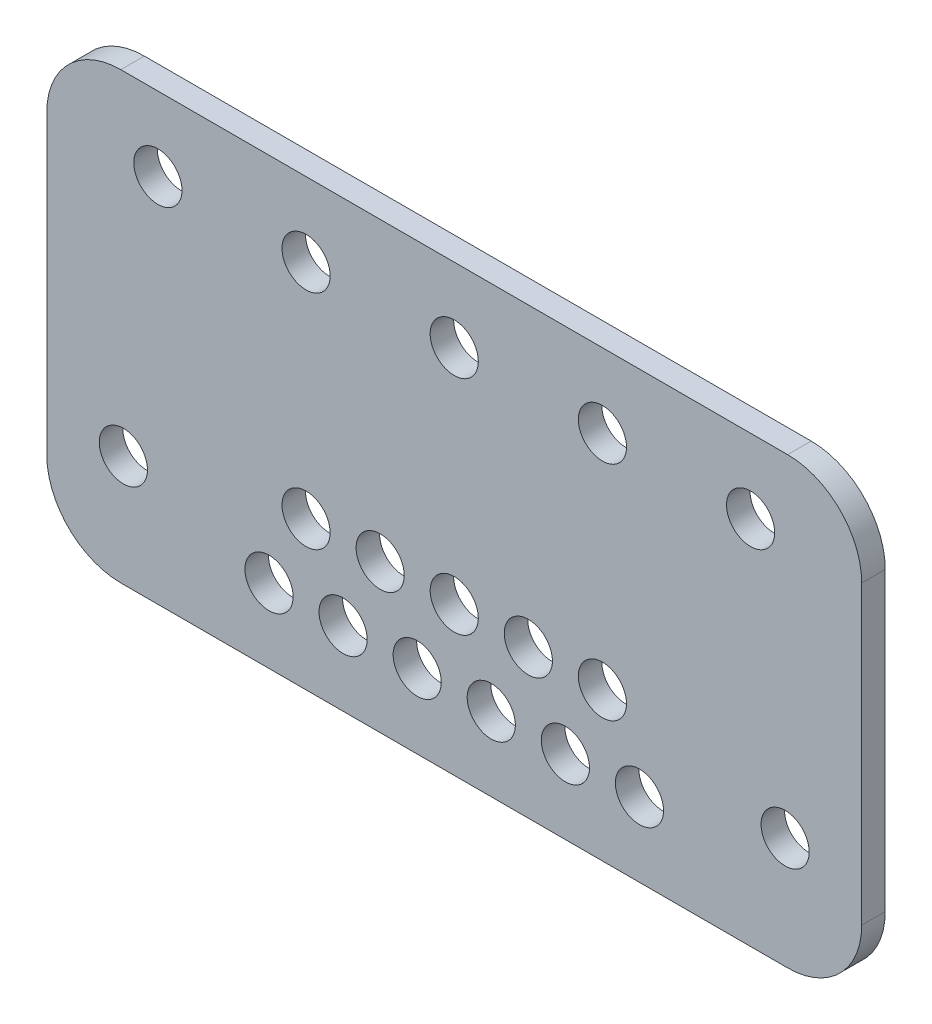
ISO-10303-21;
HEADER;
FILE_DESCRIPTION(('STEP AP214'),'2;1');
FILE_NAME('part.step','',(''),(''),'','','');
FILE_SCHEMA(('AUTOMOTIVE_DESIGN { 1 0 10303 214 1 1 1 1 }'));
ENDSEC;
DATA;
#1=APPLICATION_CONTEXT('core data for automotive mechanical design processes');
#2=APPLICATION_PROTOCOL_DEFINITION('international standard','automotive_design',2000,#1);
#3=PRODUCT_CONTEXT('',#1,'mechanical');
#4=PRODUCT('Part','Part','',(#3));
#5=PRODUCT_RELATED_PRODUCT_CATEGORY('part','',(#4));
#6=PRODUCT_DEFINITION_FORMATION('','',#4);
#7=PRODUCT_DEFINITION_CONTEXT('part definition',#1,'design');
#8=PRODUCT_DEFINITION('design','',#6,#7);
#9=PRODUCT_DEFINITION_SHAPE('','',#8);
#10=(LENGTH_UNIT() NAMED_UNIT(*) SI_UNIT(.MILLI.,.METRE.));
#11=(NAMED_UNIT(*) PLANE_ANGLE_UNIT() SI_UNIT($,.RADIAN.));
#12=(NAMED_UNIT(*) SI_UNIT($,.STERADIAN.) SOLID_ANGLE_UNIT());
#13=UNCERTAINTY_MEASURE_WITH_UNIT(LENGTH_MEASURE(1.E-05),#10,'distance_accuracy_value','');
#14=(GEOMETRIC_REPRESENTATION_CONTEXT(3) GLOBAL_UNCERTAINTY_ASSIGNED_CONTEXT((#13)) GLOBAL_UNIT_ASSIGNED_CONTEXT((#10,
#11,#12)) REPRESENTATION_CONTEXT('',''));
#15=CARTESIAN_POINT('',(0.,0.,0.));
#16=DIRECTION('',(0.,0.,1.));
#17=DIRECTION('',(1.,0.,0.));
#18=AXIS2_PLACEMENT_3D('',#15,#16,#17);
#19=CARTESIAN_POINT('',(55.,-30.,3.175));
#20=DIRECTION('',(-1.,0.,0.));
#21=DIRECTION('',(0.,0.,1.));
#22=AXIS2_PLACEMENT_3D('',#19,#20,#21);
#23=PLANE('',#22);
#24=DIRECTION('',(0.,1.,0.));
#25=VECTOR('',#24,1.);
#26=CARTESIAN_POINT('',(55.,-30.,0.));
#27=LINE('',#26,#25);
#28=CARTESIAN_POINT('',(55.,-20.,0.));
#29=VERTEX_POINT('',#28);
#30=CARTESIAN_POINT('',(55.,20.,0.));
#31=VERTEX_POINT('',#30);
#32=EDGE_CURVE('E127',#29,#31,#27,.T.);
#33=ORIENTED_EDGE('',*,*,#32,.T.);
#34=DIRECTION('',(0.,0.,-1.));
#35=VECTOR('',#34,1.);
#36=CARTESIAN_POINT('',(55.,20.,3.175));
#37=LINE('',#36,#35);
#38=CARTESIAN_POINT('',(55.,20.,3.175));
#39=VERTEX_POINT('',#38);
#40=EDGE_CURVE('E105',#31,#39,#37,.F.);
#41=ORIENTED_EDGE('',*,*,#40,.T.);
#42=DIRECTION('',(0.,1.,0.));
#43=VECTOR('',#42,1.);
#44=CARTESIAN_POINT('',(55.,-30.,3.175));
#45=LINE('',#44,#43);
#46=CARTESIAN_POINT('',(55.,-20.,3.175));
#47=VERTEX_POINT('',#46);
#48=EDGE_CURVE('E137',#47,#39,#45,.T.);
#49=ORIENTED_EDGE('',*,*,#48,.F.);
#50=DIRECTION('',(0.,0.,-1.));
#51=VECTOR('',#50,1.);
#52=CARTESIAN_POINT('',(55.,-20.,3.175));
#53=LINE('',#52,#51);
#54=EDGE_CURVE('E110',#47,#29,#53,.T.);
#55=ORIENTED_EDGE('',*,*,#54,.T.);
#56=EDGE_LOOP('',(#33,#41,#49,#55));
#57=FACE_BOUND('',#56,.T.);
#58=ADVANCED_FACE('F34',(#57),#23,.F.);
#59=CARTESIAN_POINT('',(-55.,30.,3.175));
#60=DIRECTION('',(0.,-1.,0.));
#61=DIRECTION('',(0.,0.,-1.));
#62=AXIS2_PLACEMENT_3D('',#59,#60,#61);
#63=PLANE('',#62);
#64=DIRECTION('',(-1.,0.,0.));
#65=VECTOR('',#64,1.);
#66=CARTESIAN_POINT('',(-55.,30.,3.175));
#67=LINE('',#66,#65);
#68=CARTESIAN_POINT('',(45.,30.,3.175));
#69=VERTEX_POINT('',#68);
#70=CARTESIAN_POINT('',(-45.,30.,3.175));
#71=VERTEX_POINT('',#70);
#72=EDGE_CURVE('E120',#69,#71,#67,.T.);
#73=ORIENTED_EDGE('',*,*,#72,.F.);
#74=DIRECTION('',(0.,0.,-1.));
#75=VECTOR('',#74,1.);
#76=CARTESIAN_POINT('',(45.,30.,3.175));
#77=LINE('',#76,#75);
#78=CARTESIAN_POINT('',(45.,30.,0.));
#79=VERTEX_POINT('',#78);
#80=EDGE_CURVE('E104',#69,#79,#77,.T.);
#81=ORIENTED_EDGE('',*,*,#80,.T.);
#82=DIRECTION('',(-1.,0.,0.));
#83=VECTOR('',#82,1.);
#84=CARTESIAN_POINT('',(-55.,30.,0.));
#85=LINE('',#84,#83);
#86=CARTESIAN_POINT('',(-45.,30.,0.));
#87=VERTEX_POINT('',#86);
#88=EDGE_CURVE('E117',#79,#87,#85,.T.);
#89=ORIENTED_EDGE('',*,*,#88,.T.);
#90=DIRECTION('',(0.,0.,-1.));
#91=VECTOR('',#90,1.);
#92=CARTESIAN_POINT('',(-45.,30.,3.175));
#93=LINE('',#92,#91);
#94=EDGE_CURVE('E122',#87,#71,#93,.F.);
#95=ORIENTED_EDGE('',*,*,#94,.T.);
#96=EDGE_LOOP('',(#73,#81,#89,#95));
#97=FACE_BOUND('',#96,.T.);
#98=ADVANCED_FACE('F116',(#97),#63,.F.);
#99=CARTESIAN_POINT('',(-55.,-30.,3.175));
#100=DIRECTION('',(1.,0.,0.));
#101=DIRECTION('',(0.,0.,-1.));
#102=AXIS2_PLACEMENT_3D('',#99,#100,#101);
#103=PLANE('',#102);
#104=DIRECTION('',(0.,-1.,0.));
#105=VECTOR('',#104,1.);
#106=CARTESIAN_POINT('',(-55.,-30.,3.175));
#107=LINE('',#106,#105);
#108=CARTESIAN_POINT('',(-55.,20.,3.175));
#109=VERTEX_POINT('',#108);
#110=CARTESIAN_POINT('',(-55.,-20.,3.175));
#111=VERTEX_POINT('',#110);
#112=EDGE_CURVE('E163',#109,#111,#107,.T.);
#113=ORIENTED_EDGE('',*,*,#112,.F.);
#114=DIRECTION('',(0.,0.,-1.));
#115=VECTOR('',#114,1.);
#116=CARTESIAN_POINT('',(-55.,20.,3.175));
#117=LINE('',#116,#115);
#118=CARTESIAN_POINT('',(-55.,20.,0.));
#119=VERTEX_POINT('',#118);
#120=EDGE_CURVE('E156',#109,#119,#117,.T.);
#121=ORIENTED_EDGE('',*,*,#120,.T.);
#122=DIRECTION('',(0.,-1.,0.));
#123=VECTOR('',#122,1.);
#124=CARTESIAN_POINT('',(-55.,-30.,0.));
#125=LINE('',#124,#123);
#126=CARTESIAN_POINT('',(-55.,-20.,0.));
#127=VERTEX_POINT('',#126);
#128=EDGE_CURVE('E126',#119,#127,#125,.T.);
#129=ORIENTED_EDGE('',*,*,#128,.T.);
#130=DIRECTION('',(0.,0.,-1.));
#131=VECTOR('',#130,1.);
#132=CARTESIAN_POINT('',(-55.,-20.,3.175));
#133=LINE('',#132,#131);
#134=EDGE_CURVE('E154',#127,#111,#133,.F.);
#135=ORIENTED_EDGE('',*,*,#134,.T.);
#136=EDGE_LOOP('',(#113,#121,#129,#135));
#137=FACE_BOUND('',#136,.T.);
#138=ADVANCED_FACE('F161',(#137),#103,.F.);
#139=CARTESIAN_POINT('',(-55.,-30.,3.175));
#140=DIRECTION('',(0.,1.,0.));
#141=DIRECTION('',(0.,0.,1.));
#142=AXIS2_PLACEMENT_3D('',#139,#140,#141);
#143=PLANE('',#142);
#144=DIRECTION('',(1.,0.,0.));
#145=VECTOR('',#144,1.);
#146=CARTESIAN_POINT('',(-55.,-30.,3.175));
#147=LINE('',#146,#145);
#148=CARTESIAN_POINT('',(-45.,-30.,3.175));
#149=VERTEX_POINT('',#148);
#150=CARTESIAN_POINT('',(45.,-30.,3.175));
#151=VERTEX_POINT('',#150);
#152=EDGE_CURVE('E138',#149,#151,#147,.T.);
#153=ORIENTED_EDGE('',*,*,#152,.F.);
#154=DIRECTION('',(0.,0.,-1.));
#155=VECTOR('',#154,1.);
#156=CARTESIAN_POINT('',(-45.,-30.,3.175));
#157=LINE('',#156,#155);
#158=CARTESIAN_POINT('',(-45.,-30.,0.));
#159=VERTEX_POINT('',#158);
#160=EDGE_CURVE('E11',#149,#159,#157,.T.);
#161=ORIENTED_EDGE('',*,*,#160,.T.);
#162=DIRECTION('',(1.,0.,0.));
#163=VECTOR('',#162,1.);
#164=CARTESIAN_POINT('',(-55.,-30.,0.));
#165=LINE('',#164,#163);
#166=CARTESIAN_POINT('',(45.,-30.,0.));
#167=VERTEX_POINT('',#166);
#168=EDGE_CURVE('E130',#159,#167,#165,.T.);
#169=ORIENTED_EDGE('',*,*,#168,.T.);
#170=DIRECTION('',(0.,0.,-1.));
#171=VECTOR('',#170,1.);
#172=CARTESIAN_POINT('',(45.,-30.,3.175));
#173=LINE('',#172,#171);
#174=EDGE_CURVE('E42',#167,#151,#173,.F.);
#175=ORIENTED_EDGE('',*,*,#174,.T.);
#176=EDGE_LOOP('',(#153,#161,#169,#175));
#177=FACE_BOUND('',#176,.T.);
#178=ADVANCED_FACE('F170',(#177),#143,.F.);
#179=CARTESIAN_POINT('',(0.,0.,3.175));
#180=DIRECTION('',(0.,0.,-1.));
#181=DIRECTION('',(-1.,0.,0.));
#182=AXIS2_PLACEMENT_3D('',#179,#180,#181);
#183=PLANE('',#182);
#184=CARTESIAN_POINT('',(25.,-20.,3.175));
#185=DIRECTION('',(0.,0.,1.));
#186=DIRECTION('',(1.,0.,0.));
#187=AXIS2_PLACEMENT_3D('',#184,#185,#186);
#188=CIRCLE('',#187,3.25);
#189=CARTESIAN_POINT('',(28.25,-20.,3.175));
#190=VERTEX_POINT('',#189);
#191=EDGE_CURVE('E279',#190,#190,#188,.T.);
#192=ORIENTED_EDGE('',*,*,#191,.F.);
#193=EDGE_LOOP('',(#192));
#194=FACE_BOUND('',#193,.T.);
#195=CARTESIAN_POINT('',(-25.,-20.,3.175));
#196=DIRECTION('',(0.,0.,1.));
#197=DIRECTION('',(1.,0.,0.));
#198=AXIS2_PLACEMENT_3D('',#195,#196,#197);
#199=CIRCLE('',#198,3.25);
#200=CARTESIAN_POINT('',(-21.75,-20.,3.175));
#201=VERTEX_POINT('',#200);
#202=EDGE_CURVE('E273',#201,#201,#199,.T.);
#203=ORIENTED_EDGE('',*,*,#202,.F.);
#204=EDGE_LOOP('',(#203));
#205=FACE_BOUND('',#204,.T.);
#206=CARTESIAN_POINT('',(15.,-20.,3.175));
#207=DIRECTION('',(0.,0.,1.));
#208=DIRECTION('',(1.,0.,0.));
#209=AXIS2_PLACEMENT_3D('',#206,#207,#208);
#210=CIRCLE('',#209,3.25);
#211=CARTESIAN_POINT('',(18.25,-20.,3.175));
#212=VERTEX_POINT('',#211);
#213=EDGE_CURVE('E267',#212,#212,#210,.T.);
#214=ORIENTED_EDGE('',*,*,#213,.F.);
#215=EDGE_LOOP('',(#214));
#216=FACE_BOUND('',#215,.T.);
#217=CARTESIAN_POINT('',(20.,-9.99999999999999,3.175));
#218=DIRECTION('',(0.,0.,1.));
#219=DIRECTION('',(1.,0.,0.));
#220=AXIS2_PLACEMENT_3D('',#217,#218,#219);
#221=CIRCLE('',#220,3.25);
#222=CARTESIAN_POINT('',(23.25,-9.99999999999999,3.175));
#223=VERTEX_POINT('',#222);
#224=EDGE_CURVE('E261',#223,#223,#221,.T.);
#225=ORIENTED_EDGE('',*,*,#224,.F.);
#226=EDGE_LOOP('',(#225));
#227=FACE_BOUND('',#226,.T.);
#228=CARTESIAN_POINT('',(-44.66,-15.,3.175));
#229=DIRECTION('',(0.,0.,1.));
#230=DIRECTION('',(1.,0.,0.));
#231=AXIS2_PLACEMENT_3D('',#228,#229,#230);
#232=CIRCLE('',#231,3.25);
#233=CARTESIAN_POINT('',(-41.41,-15.,3.175));
#234=VERTEX_POINT('',#233);
#235=EDGE_CURVE('E255',#234,#234,#232,.T.);
#236=ORIENTED_EDGE('',*,*,#235,.F.);
#237=EDGE_LOOP('',(#236));
#238=FACE_BOUND('',#237,.T.);
#239=CARTESIAN_POINT('',(-20.,-9.99999999999999,3.175));
#240=DIRECTION('',(0.,0.,1.));
#241=DIRECTION('',(1.,0.,0.));
#242=AXIS2_PLACEMENT_3D('',#239,#240,#241);
#243=CIRCLE('',#242,3.25);
#244=CARTESIAN_POINT('',(-16.75,-9.99999999999999,3.175));
#245=VERTEX_POINT('',#244);
#246=EDGE_CURVE('E249',#245,#245,#243,.T.);
#247=ORIENTED_EDGE('',*,*,#246,.F.);
#248=EDGE_LOOP('',(#247));
#249=FACE_BOUND('',#248,.T.);
#250=CARTESIAN_POINT('',(10.,-9.99999999999999,3.175));
#251=DIRECTION('',(0.,0.,1.));
#252=DIRECTION('',(1.,0.,0.));
#253=AXIS2_PLACEMENT_3D('',#250,#251,#252);
#254=CIRCLE('',#253,3.25);
#255=CARTESIAN_POINT('',(13.25,-9.99999999999999,3.175));
#256=VERTEX_POINT('',#255);
#257=EDGE_CURVE('E243',#256,#256,#254,.T.);
#258=ORIENTED_EDGE('',*,*,#257,.F.);
#259=EDGE_LOOP('',(#258));
#260=FACE_BOUND('',#259,.T.);
#261=CARTESIAN_POINT('',(-15.,-20.,3.175));
#262=DIRECTION('',(0.,0.,1.));
#263=DIRECTION('',(1.,0.,0.));
#264=AXIS2_PLACEMENT_3D('',#261,#262,#263);
#265=CIRCLE('',#264,3.25);
#266=CARTESIAN_POINT('',(-11.75,-20.,3.175));
#267=VERTEX_POINT('',#266);
#268=EDGE_CURVE('E237',#267,#267,#265,.T.);
#269=ORIENTED_EDGE('',*,*,#268,.F.);
#270=EDGE_LOOP('',(#269));
#271=FACE_BOUND('',#270,.T.);
#272=CARTESIAN_POINT('',(-10.,-9.99999999999999,3.175));
#273=DIRECTION('',(0.,0.,1.));
#274=DIRECTION('',(1.,0.,0.));
#275=AXIS2_PLACEMENT_3D('',#272,#273,#274);
#276=CIRCLE('',#275,3.25);
#277=CARTESIAN_POINT('',(-6.75,-9.99999999999999,3.175));
#278=VERTEX_POINT('',#277);
#279=EDGE_CURVE('E231',#278,#278,#276,.T.);
#280=ORIENTED_EDGE('',*,*,#279,.F.);
#281=EDGE_LOOP('',(#280));
#282=FACE_BOUND('',#281,.T.);
#283=CARTESIAN_POINT('',(-5.,-20.,3.175));
#284=DIRECTION('',(0.,0.,1.));
#285=DIRECTION('',(1.,0.,0.));
#286=AXIS2_PLACEMENT_3D('',#283,#284,#285);
#287=CIRCLE('',#286,3.25);
#288=CARTESIAN_POINT('',(-1.75,-20.,3.175));
#289=VERTEX_POINT('',#288);
#290=EDGE_CURVE('E225',#289,#289,#287,.T.);
#291=ORIENTED_EDGE('',*,*,#290,.F.);
#292=EDGE_LOOP('',(#291));
#293=FACE_BOUND('',#292,.T.);
#294=CARTESIAN_POINT('',(0.,-9.99999999999999,3.175));
#295=DIRECTION('',(0.,0.,1.));
#296=DIRECTION('',(1.,0.,0.));
#297=AXIS2_PLACEMENT_3D('',#294,#295,#296);
#298=CIRCLE('',#297,3.25);
#299=CARTESIAN_POINT('',(3.25,-9.99999999999999,3.175));
#300=VERTEX_POINT('',#299);
#301=EDGE_CURVE('E219',#300,#300,#298,.T.);
#302=ORIENTED_EDGE('',*,*,#301,.F.);
#303=EDGE_LOOP('',(#302));
#304=FACE_BOUND('',#303,.T.);
#305=CARTESIAN_POINT('',(5.,-20.,3.175));
#306=DIRECTION('',(0.,0.,1.));
#307=DIRECTION('',(1.,0.,0.));
#308=AXIS2_PLACEMENT_3D('',#305,#306,#307);
#309=CIRCLE('',#308,3.25);
#310=CARTESIAN_POINT('',(8.25,-20.,3.175));
#311=VERTEX_POINT('',#310);
#312=EDGE_CURVE('E213',#311,#311,#309,.T.);
#313=ORIENTED_EDGE('',*,*,#312,.F.);
#314=EDGE_LOOP('',(#313));
#315=FACE_BOUND('',#314,.T.);
#316=CARTESIAN_POINT('',(44.66,-15.,3.175));
#317=DIRECTION('',(0.,0.,1.));
#318=DIRECTION('',(1.,0.,0.));
#319=AXIS2_PLACEMENT_3D('',#316,#317,#318);
#320=CIRCLE('',#319,3.25);
#321=CARTESIAN_POINT('',(47.91,-15.,3.175));
#322=VERTEX_POINT('',#321);
#323=EDGE_CURVE('E207',#322,#322,#320,.T.);
#324=ORIENTED_EDGE('',*,*,#323,.F.);
#325=EDGE_LOOP('',(#324));
#326=FACE_BOUND('',#325,.T.);
#327=CARTESIAN_POINT('',(20.,20.,3.175));
#328=DIRECTION('',(0.,0.,1.));
#329=DIRECTION('',(1.,0.,0.));
#330=AXIS2_PLACEMENT_3D('',#327,#328,#329);
#331=CIRCLE('',#330,3.25);
#332=CARTESIAN_POINT('',(23.25,20.,3.175));
#333=VERTEX_POINT('',#332);
#334=EDGE_CURVE('E201',#333,#333,#331,.T.);
#335=ORIENTED_EDGE('',*,*,#334,.F.);
#336=EDGE_LOOP('',(#335));
#337=FACE_BOUND('',#336,.T.);
#338=CARTESIAN_POINT('',(0.,20.,3.175));
#339=DIRECTION('',(0.,0.,1.));
#340=DIRECTION('',(1.,0.,0.));
#341=AXIS2_PLACEMENT_3D('',#338,#339,#340);
#342=CIRCLE('',#341,3.25);
#343=CARTESIAN_POINT('',(3.25,20.,3.175));
#344=VERTEX_POINT('',#343);
#345=EDGE_CURVE('E195',#344,#344,#342,.T.);
#346=ORIENTED_EDGE('',*,*,#345,.F.);
#347=EDGE_LOOP('',(#346));
#348=FACE_BOUND('',#347,.T.);
#349=CARTESIAN_POINT('',(-20.,20.,3.175));
#350=DIRECTION('',(0.,0.,1.));
#351=DIRECTION('',(1.,0.,0.));
#352=AXIS2_PLACEMENT_3D('',#349,#350,#351);
#353=CIRCLE('',#352,3.25);
#354=CARTESIAN_POINT('',(-16.75,20.,3.175));
#355=VERTEX_POINT('',#354);
#356=EDGE_CURVE('E189',#355,#355,#353,.T.);
#357=ORIENTED_EDGE('',*,*,#356,.F.);
#358=EDGE_LOOP('',(#357));
#359=FACE_BOUND('',#358,.T.);
#360=CARTESIAN_POINT('',(40.,20.,3.175));
#361=DIRECTION('',(0.,0.,1.));
#362=DIRECTION('',(1.,0.,0.));
#363=AXIS2_PLACEMENT_3D('',#360,#361,#362);
#364=CIRCLE('',#363,3.25);
#365=CARTESIAN_POINT('',(43.25,20.,3.175));
#366=VERTEX_POINT('',#365);
#367=EDGE_CURVE('E183',#366,#366,#364,.T.);
#368=ORIENTED_EDGE('',*,*,#367,.F.);
#369=EDGE_LOOP('',(#368));
#370=FACE_BOUND('',#369,.T.);
#371=CARTESIAN_POINT('',(-40.,20.,3.175));
#372=DIRECTION('',(0.,0.,1.));
#373=DIRECTION('',(1.,0.,0.));
#374=AXIS2_PLACEMENT_3D('',#371,#372,#373);
#375=CIRCLE('',#374,3.25);
#376=CARTESIAN_POINT('',(-36.75,20.,3.175));
#377=VERTEX_POINT('',#376);
#378=EDGE_CURVE('E177',#377,#377,#375,.T.);
#379=ORIENTED_EDGE('',*,*,#378,.F.);
#380=EDGE_LOOP('',(#379));
#381=FACE_BOUND('',#380,.T.);
#382=ORIENTED_EDGE('',*,*,#48,.T.);
#383=CARTESIAN_POINT('',(45.,20.,3.175));
#384=DIRECTION('',(0.,0.,-1.));
#385=DIRECTION('',(-1.,0.,0.));
#386=AXIS2_PLACEMENT_3D('',#383,#384,#385);
#387=CIRCLE('',#386,10.);
#388=EDGE_CURVE('E152',#39,#69,#387,.F.);
#389=ORIENTED_EDGE('',*,*,#388,.T.);
#390=ORIENTED_EDGE('',*,*,#72,.T.);
#391=CARTESIAN_POINT('',(-45.,20.,3.175));
#392=DIRECTION('',(0.,0.,-1.));
#393=DIRECTION('',(-1.,0.,0.));
#394=AXIS2_PLACEMENT_3D('',#391,#392,#393);
#395=CIRCLE('',#394,10.);
#396=EDGE_CURVE('E150',#71,#109,#395,.F.);
#397=ORIENTED_EDGE('',*,*,#396,.T.);
#398=ORIENTED_EDGE('',*,*,#112,.T.);
#399=CARTESIAN_POINT('',(-45.,-20.,3.175));
#400=DIRECTION('',(0.,0.,-1.));
#401=DIRECTION('',(-1.,0.,0.));
#402=AXIS2_PLACEMENT_3D('',#399,#400,#401);
#403=CIRCLE('',#402,10.);
#404=EDGE_CURVE('E55',#111,#149,#403,.F.);
#405=ORIENTED_EDGE('',*,*,#404,.T.);
#406=ORIENTED_EDGE('',*,*,#152,.T.);
#407=CARTESIAN_POINT('',(45.,-20.,3.175));
#408=DIRECTION('',(0.,0.,-1.));
#409=DIRECTION('',(-1.,0.,0.));
#410=AXIS2_PLACEMENT_3D('',#407,#408,#409);
#411=CIRCLE('',#410,10.);
#412=EDGE_CURVE('E147',#151,#47,#411,.F.);
#413=ORIENTED_EDGE('',*,*,#412,.T.);
#414=EDGE_LOOP('',(#382,#389,#390,#397,#398,#405,#406,#413));
#415=FACE_BOUND('',#414,.T.);
#416=ADVANCED_FACE('F294',(#194,#205,#216,#227,#238,#249,#260,#271,#282,#293,#304,#315,#326,
#337,#348,#359,#370,#381,#415),#183,.F.);
#417=CARTESIAN_POINT('',(0.,0.,0.));
#418=DIRECTION('',(0.,0.,-1.));
#419=DIRECTION('',(-1.,0.,0.));
#420=AXIS2_PLACEMENT_3D('',#417,#418,#419);
#421=PLANE('',#420);
#422=CARTESIAN_POINT('',(25.,-20.,0.));
#423=DIRECTION('',(0.,0.,1.));
#424=DIRECTION('',(1.,0.,0.));
#425=AXIS2_PLACEMENT_3D('',#422,#423,#424);
#426=CIRCLE('',#425,3.25);
#427=CARTESIAN_POINT('',(28.25,-20.,0.));
#428=VERTEX_POINT('',#427);
#429=EDGE_CURVE('E276',#428,#428,#426,.T.);
#430=ORIENTED_EDGE('',*,*,#429,.T.);
#431=EDGE_LOOP('',(#430));
#432=FACE_BOUND('',#431,.T.);
#433=CARTESIAN_POINT('',(-25.,-20.,0.));
#434=DIRECTION('',(0.,0.,1.));
#435=DIRECTION('',(1.,0.,0.));
#436=AXIS2_PLACEMENT_3D('',#433,#434,#435);
#437=CIRCLE('',#436,3.25);
#438=CARTESIAN_POINT('',(-21.75,-20.,0.));
#439=VERTEX_POINT('',#438);
#440=EDGE_CURVE('E270',#439,#439,#437,.T.);
#441=ORIENTED_EDGE('',*,*,#440,.T.);
#442=EDGE_LOOP('',(#441));
#443=FACE_BOUND('',#442,.T.);
#444=CARTESIAN_POINT('',(15.,-20.,0.));
#445=DIRECTION('',(0.,0.,1.));
#446=DIRECTION('',(1.,0.,0.));
#447=AXIS2_PLACEMENT_3D('',#444,#445,#446);
#448=CIRCLE('',#447,3.25);
#449=CARTESIAN_POINT('',(18.25,-20.,0.));
#450=VERTEX_POINT('',#449);
#451=EDGE_CURVE('E264',#450,#450,#448,.T.);
#452=ORIENTED_EDGE('',*,*,#451,.T.);
#453=EDGE_LOOP('',(#452));
#454=FACE_BOUND('',#453,.T.);
#455=CARTESIAN_POINT('',(20.,-9.99999999999999,0.));
#456=DIRECTION('',(0.,0.,1.));
#457=DIRECTION('',(1.,0.,0.));
#458=AXIS2_PLACEMENT_3D('',#455,#456,#457);
#459=CIRCLE('',#458,3.25);
#460=CARTESIAN_POINT('',(23.25,-9.99999999999999,0.));
#461=VERTEX_POINT('',#460);
#462=EDGE_CURVE('E258',#461,#461,#459,.T.);
#463=ORIENTED_EDGE('',*,*,#462,.T.);
#464=EDGE_LOOP('',(#463));
#465=FACE_BOUND('',#464,.T.);
#466=CARTESIAN_POINT('',(-44.66,-15.,0.));
#467=DIRECTION('',(0.,0.,1.));
#468=DIRECTION('',(1.,0.,0.));
#469=AXIS2_PLACEMENT_3D('',#466,#467,#468);
#470=CIRCLE('',#469,3.25);
#471=CARTESIAN_POINT('',(-41.41,-15.,0.));
#472=VERTEX_POINT('',#471);
#473=EDGE_CURVE('E252',#472,#472,#470,.T.);
#474=ORIENTED_EDGE('',*,*,#473,.T.);
#475=EDGE_LOOP('',(#474));
#476=FACE_BOUND('',#475,.T.);
#477=CARTESIAN_POINT('',(-20.,-9.99999999999999,0.));
#478=DIRECTION('',(0.,0.,1.));
#479=DIRECTION('',(1.,0.,0.));
#480=AXIS2_PLACEMENT_3D('',#477,#478,#479);
#481=CIRCLE('',#480,3.25);
#482=CARTESIAN_POINT('',(-16.75,-9.99999999999999,0.));
#483=VERTEX_POINT('',#482);
#484=EDGE_CURVE('E246',#483,#483,#481,.T.);
#485=ORIENTED_EDGE('',*,*,#484,.T.);
#486=EDGE_LOOP('',(#485));
#487=FACE_BOUND('',#486,.T.);
#488=CARTESIAN_POINT('',(10.,-9.99999999999999,0.));
#489=DIRECTION('',(0.,0.,1.));
#490=DIRECTION('',(1.,0.,0.));
#491=AXIS2_PLACEMENT_3D('',#488,#489,#490);
#492=CIRCLE('',#491,3.25);
#493=CARTESIAN_POINT('',(13.25,-9.99999999999999,0.));
#494=VERTEX_POINT('',#493);
#495=EDGE_CURVE('E240',#494,#494,#492,.T.);
#496=ORIENTED_EDGE('',*,*,#495,.T.);
#497=EDGE_LOOP('',(#496));
#498=FACE_BOUND('',#497,.T.);
#499=CARTESIAN_POINT('',(-15.,-20.,0.));
#500=DIRECTION('',(0.,0.,1.));
#501=DIRECTION('',(1.,0.,0.));
#502=AXIS2_PLACEMENT_3D('',#499,#500,#501);
#503=CIRCLE('',#502,3.25);
#504=CARTESIAN_POINT('',(-11.75,-20.,0.));
#505=VERTEX_POINT('',#504);
#506=EDGE_CURVE('E234',#505,#505,#503,.T.);
#507=ORIENTED_EDGE('',*,*,#506,.T.);
#508=EDGE_LOOP('',(#507));
#509=FACE_BOUND('',#508,.T.);
#510=CARTESIAN_POINT('',(-10.,-9.99999999999999,0.));
#511=DIRECTION('',(0.,0.,1.));
#512=DIRECTION('',(1.,0.,0.));
#513=AXIS2_PLACEMENT_3D('',#510,#511,#512);
#514=CIRCLE('',#513,3.25);
#515=CARTESIAN_POINT('',(-6.75,-9.99999999999999,0.));
#516=VERTEX_POINT('',#515);
#517=EDGE_CURVE('E228',#516,#516,#514,.T.);
#518=ORIENTED_EDGE('',*,*,#517,.T.);
#519=EDGE_LOOP('',(#518));
#520=FACE_BOUND('',#519,.T.);
#521=CARTESIAN_POINT('',(-5.,-20.,0.));
#522=DIRECTION('',(0.,0.,1.));
#523=DIRECTION('',(1.,0.,0.));
#524=AXIS2_PLACEMENT_3D('',#521,#522,#523);
#525=CIRCLE('',#524,3.25);
#526=CARTESIAN_POINT('',(-1.75,-20.,0.));
#527=VERTEX_POINT('',#526);
#528=EDGE_CURVE('E222',#527,#527,#525,.T.);
#529=ORIENTED_EDGE('',*,*,#528,.T.);
#530=EDGE_LOOP('',(#529));
#531=FACE_BOUND('',#530,.T.);
#532=CARTESIAN_POINT('',(0.,-9.99999999999999,0.));
#533=DIRECTION('',(0.,0.,1.));
#534=DIRECTION('',(1.,0.,0.));
#535=AXIS2_PLACEMENT_3D('',#532,#533,#534);
#536=CIRCLE('',#535,3.25);
#537=CARTESIAN_POINT('',(3.25,-9.99999999999999,0.));
#538=VERTEX_POINT('',#537);
#539=EDGE_CURVE('E216',#538,#538,#536,.T.);
#540=ORIENTED_EDGE('',*,*,#539,.T.);
#541=EDGE_LOOP('',(#540));
#542=FACE_BOUND('',#541,.T.);
#543=CARTESIAN_POINT('',(5.,-20.,0.));
#544=DIRECTION('',(0.,0.,1.));
#545=DIRECTION('',(1.,0.,0.));
#546=AXIS2_PLACEMENT_3D('',#543,#544,#545);
#547=CIRCLE('',#546,3.25);
#548=CARTESIAN_POINT('',(8.25,-20.,0.));
#549=VERTEX_POINT('',#548);
#550=EDGE_CURVE('E210',#549,#549,#547,.T.);
#551=ORIENTED_EDGE('',*,*,#550,.T.);
#552=EDGE_LOOP('',(#551));
#553=FACE_BOUND('',#552,.T.);
#554=CARTESIAN_POINT('',(44.66,-15.,0.));
#555=DIRECTION('',(0.,0.,1.));
#556=DIRECTION('',(1.,0.,0.));
#557=AXIS2_PLACEMENT_3D('',#554,#555,#556);
#558=CIRCLE('',#557,3.25);
#559=CARTESIAN_POINT('',(47.91,-15.,0.));
#560=VERTEX_POINT('',#559);
#561=EDGE_CURVE('E204',#560,#560,#558,.T.);
#562=ORIENTED_EDGE('',*,*,#561,.T.);
#563=EDGE_LOOP('',(#562));
#564=FACE_BOUND('',#563,.T.);
#565=CARTESIAN_POINT('',(20.,20.,0.));
#566=DIRECTION('',(0.,0.,1.));
#567=DIRECTION('',(1.,0.,0.));
#568=AXIS2_PLACEMENT_3D('',#565,#566,#567);
#569=CIRCLE('',#568,3.25);
#570=CARTESIAN_POINT('',(23.25,20.,0.));
#571=VERTEX_POINT('',#570);
#572=EDGE_CURVE('E198',#571,#571,#569,.T.);
#573=ORIENTED_EDGE('',*,*,#572,.T.);
#574=EDGE_LOOP('',(#573));
#575=FACE_BOUND('',#574,.T.);
#576=CARTESIAN_POINT('',(0.,20.,0.));
#577=DIRECTION('',(0.,0.,1.));
#578=DIRECTION('',(1.,0.,0.));
#579=AXIS2_PLACEMENT_3D('',#576,#577,#578);
#580=CIRCLE('',#579,3.25);
#581=CARTESIAN_POINT('',(3.25,20.,0.));
#582=VERTEX_POINT('',#581);
#583=EDGE_CURVE('E192',#582,#582,#580,.T.);
#584=ORIENTED_EDGE('',*,*,#583,.T.);
#585=EDGE_LOOP('',(#584));
#586=FACE_BOUND('',#585,.T.);
#587=CARTESIAN_POINT('',(-20.,20.,0.));
#588=DIRECTION('',(0.,0.,1.));
#589=DIRECTION('',(1.,0.,0.));
#590=AXIS2_PLACEMENT_3D('',#587,#588,#589);
#591=CIRCLE('',#590,3.25);
#592=CARTESIAN_POINT('',(-16.75,20.,0.));
#593=VERTEX_POINT('',#592);
#594=EDGE_CURVE('E186',#593,#593,#591,.T.);
#595=ORIENTED_EDGE('',*,*,#594,.T.);
#596=EDGE_LOOP('',(#595));
#597=FACE_BOUND('',#596,.T.);
#598=CARTESIAN_POINT('',(40.,20.,0.));
#599=DIRECTION('',(0.,0.,1.));
#600=DIRECTION('',(1.,0.,0.));
#601=AXIS2_PLACEMENT_3D('',#598,#599,#600);
#602=CIRCLE('',#601,3.25);
#603=CARTESIAN_POINT('',(43.25,20.,0.));
#604=VERTEX_POINT('',#603);
#605=EDGE_CURVE('E180',#604,#604,#602,.T.);
#606=ORIENTED_EDGE('',*,*,#605,.T.);
#607=EDGE_LOOP('',(#606));
#608=FACE_BOUND('',#607,.T.);
#609=CARTESIAN_POINT('',(-40.,20.,0.));
#610=DIRECTION('',(0.,0.,1.));
#611=DIRECTION('',(1.,0.,0.));
#612=AXIS2_PLACEMENT_3D('',#609,#610,#611);
#613=CIRCLE('',#612,3.25);
#614=CARTESIAN_POINT('',(-36.75,20.,0.));
#615=VERTEX_POINT('',#614);
#616=EDGE_CURVE('E132',#615,#615,#613,.T.);
#617=ORIENTED_EDGE('',*,*,#616,.T.);
#618=EDGE_LOOP('',(#617));
#619=FACE_BOUND('',#618,.T.);
#620=ORIENTED_EDGE('',*,*,#88,.F.);
#621=CARTESIAN_POINT('',(45.,20.,0.));
#622=DIRECTION('',(0.,0.,-1.));
#623=DIRECTION('',(-1.,0.,0.));
#624=AXIS2_PLACEMENT_3D('',#621,#622,#623);
#625=CIRCLE('',#624,10.);
#626=EDGE_CURVE('E100',#79,#31,#625,.T.);
#627=ORIENTED_EDGE('',*,*,#626,.T.);
#628=ORIENTED_EDGE('',*,*,#32,.F.);
#629=CARTESIAN_POINT('',(45.,-20.,0.));
#630=DIRECTION('',(0.,0.,-1.));
#631=DIRECTION('',(-1.,0.,0.));
#632=AXIS2_PLACEMENT_3D('',#629,#630,#631);
#633=CIRCLE('',#632,10.);
#634=EDGE_CURVE('E121',#29,#167,#633,.T.);
#635=ORIENTED_EDGE('',*,*,#634,.T.);
#636=ORIENTED_EDGE('',*,*,#168,.F.);
#637=CARTESIAN_POINT('',(-45.,-20.,0.));
#638=DIRECTION('',(0.,0.,-1.));
#639=DIRECTION('',(-1.,0.,0.));
#640=AXIS2_PLACEMENT_3D('',#637,#638,#639);
#641=CIRCLE('',#640,10.);
#642=EDGE_CURVE('E141',#159,#127,#641,.T.);
#643=ORIENTED_EDGE('',*,*,#642,.T.);
#644=ORIENTED_EDGE('',*,*,#128,.F.);
#645=CARTESIAN_POINT('',(-45.,20.,0.));
#646=DIRECTION('',(0.,0.,-1.));
#647=DIRECTION('',(-1.,0.,0.));
#648=AXIS2_PLACEMENT_3D('',#645,#646,#647);
#649=CIRCLE('',#648,10.);
#650=EDGE_CURVE('E111',#119,#87,#649,.T.);
#651=ORIENTED_EDGE('',*,*,#650,.T.);
#652=EDGE_LOOP('',(#620,#627,#628,#635,#636,#643,#644,#651));
#653=FACE_BOUND('',#652,.T.);
#654=ADVANCED_FACE('F124',(#432,#443,#454,#465,#476,#487,#498,#509,#520,#531,#542,#553,#564,
#575,#586,#597,#608,#619,#653),#421,.T.);
#655=CARTESIAN_POINT('',(-40.,20.,0.));
#656=DIRECTION('',(0.,0.,1.));
#657=DIRECTION('',(1.,0.,0.));
#658=AXIS2_PLACEMENT_3D('',#655,#656,#657);
#659=CYLINDRICAL_SURFACE('',#658,3.25);
#660=ORIENTED_EDGE('',*,*,#616,.F.);
#661=EDGE_LOOP('',(#660));
#662=FACE_BOUND('',#661,.T.);
#663=ORIENTED_EDGE('',*,*,#378,.T.);
#664=EDGE_LOOP('',(#663));
#665=FACE_BOUND('',#664,.T.);
#666=ADVANCED_FACE('F520',(#662,#665),#659,.F.);
#667=CARTESIAN_POINT('',(40.,20.,0.));
#668=DIRECTION('',(0.,0.,1.));
#669=DIRECTION('',(1.,0.,0.));
#670=AXIS2_PLACEMENT_3D('',#667,#668,#669);
#671=CYLINDRICAL_SURFACE('',#670,3.25);
#672=ORIENTED_EDGE('',*,*,#605,.F.);
#673=EDGE_LOOP('',(#672));
#674=FACE_BOUND('',#673,.T.);
#675=ORIENTED_EDGE('',*,*,#367,.T.);
#676=EDGE_LOOP('',(#675));
#677=FACE_BOUND('',#676,.T.);
#678=ADVANCED_FACE('F511',(#674,#677),#671,.F.);
#679=CARTESIAN_POINT('',(-20.,20.,0.));
#680=DIRECTION('',(0.,0.,1.));
#681=DIRECTION('',(1.,0.,0.));
#682=AXIS2_PLACEMENT_3D('',#679,#680,#681);
#683=CYLINDRICAL_SURFACE('',#682,3.25);
#684=ORIENTED_EDGE('',*,*,#594,.F.);
#685=EDGE_LOOP('',(#684));
#686=FACE_BOUND('',#685,.T.);
#687=ORIENTED_EDGE('',*,*,#356,.T.);
#688=EDGE_LOOP('',(#687));
#689=FACE_BOUND('',#688,.T.);
#690=ADVANCED_FACE('F502',(#686,#689),#683,.F.);
#691=CARTESIAN_POINT('',(0.,20.,0.));
#692=DIRECTION('',(0.,0.,1.));
#693=DIRECTION('',(1.,0.,0.));
#694=AXIS2_PLACEMENT_3D('',#691,#692,#693);
#695=CYLINDRICAL_SURFACE('',#694,3.25);
#696=ORIENTED_EDGE('',*,*,#583,.F.);
#697=EDGE_LOOP('',(#696));
#698=FACE_BOUND('',#697,.T.);
#699=ORIENTED_EDGE('',*,*,#345,.T.);
#700=EDGE_LOOP('',(#699));
#701=FACE_BOUND('',#700,.T.);
#702=ADVANCED_FACE('F493',(#698,#701),#695,.F.);
#703=CARTESIAN_POINT('',(20.,20.,0.));
#704=DIRECTION('',(0.,0.,1.));
#705=DIRECTION('',(1.,0.,0.));
#706=AXIS2_PLACEMENT_3D('',#703,#704,#705);
#707=CYLINDRICAL_SURFACE('',#706,3.25);
#708=ORIENTED_EDGE('',*,*,#572,.F.);
#709=EDGE_LOOP('',(#708));
#710=FACE_BOUND('',#709,.T.);
#711=ORIENTED_EDGE('',*,*,#334,.T.);
#712=EDGE_LOOP('',(#711));
#713=FACE_BOUND('',#712,.T.);
#714=ADVANCED_FACE('F484',(#710,#713),#707,.F.);
#715=CARTESIAN_POINT('',(44.66,-15.,0.));
#716=DIRECTION('',(0.,0.,1.));
#717=DIRECTION('',(1.,0.,0.));
#718=AXIS2_PLACEMENT_3D('',#715,#716,#717);
#719=CYLINDRICAL_SURFACE('',#718,3.25);
#720=ORIENTED_EDGE('',*,*,#561,.F.);
#721=EDGE_LOOP('',(#720));
#722=FACE_BOUND('',#721,.T.);
#723=ORIENTED_EDGE('',*,*,#323,.T.);
#724=EDGE_LOOP('',(#723));
#725=FACE_BOUND('',#724,.T.);
#726=ADVANCED_FACE('F475',(#722,#725),#719,.F.);
#727=CARTESIAN_POINT('',(5.,-20.,0.));
#728=DIRECTION('',(0.,0.,1.));
#729=DIRECTION('',(1.,0.,0.));
#730=AXIS2_PLACEMENT_3D('',#727,#728,#729);
#731=CYLINDRICAL_SURFACE('',#730,3.25);
#732=ORIENTED_EDGE('',*,*,#550,.F.);
#733=EDGE_LOOP('',(#732));
#734=FACE_BOUND('',#733,.T.);
#735=ORIENTED_EDGE('',*,*,#312,.T.);
#736=EDGE_LOOP('',(#735));
#737=FACE_BOUND('',#736,.T.);
#738=ADVANCED_FACE('F466',(#734,#737),#731,.F.);
#739=CARTESIAN_POINT('',(0.,-9.99999999999999,0.));
#740=DIRECTION('',(0.,0.,1.));
#741=DIRECTION('',(1.,0.,0.));
#742=AXIS2_PLACEMENT_3D('',#739,#740,#741);
#743=CYLINDRICAL_SURFACE('',#742,3.25);
#744=ORIENTED_EDGE('',*,*,#539,.F.);
#745=EDGE_LOOP('',(#744));
#746=FACE_BOUND('',#745,.T.);
#747=ORIENTED_EDGE('',*,*,#301,.T.);
#748=EDGE_LOOP('',(#747));
#749=FACE_BOUND('',#748,.T.);
#750=ADVANCED_FACE('F457',(#746,#749),#743,.F.);
#751=CARTESIAN_POINT('',(-5.,-20.,0.));
#752=DIRECTION('',(0.,0.,1.));
#753=DIRECTION('',(1.,0.,0.));
#754=AXIS2_PLACEMENT_3D('',#751,#752,#753);
#755=CYLINDRICAL_SURFACE('',#754,3.25);
#756=ORIENTED_EDGE('',*,*,#528,.F.);
#757=EDGE_LOOP('',(#756));
#758=FACE_BOUND('',#757,.T.);
#759=ORIENTED_EDGE('',*,*,#290,.T.);
#760=EDGE_LOOP('',(#759));
#761=FACE_BOUND('',#760,.T.);
#762=ADVANCED_FACE('F448',(#758,#761),#755,.F.);
#763=CARTESIAN_POINT('',(-10.,-9.99999999999999,0.));
#764=DIRECTION('',(0.,0.,1.));
#765=DIRECTION('',(1.,0.,0.));
#766=AXIS2_PLACEMENT_3D('',#763,#764,#765);
#767=CYLINDRICAL_SURFACE('',#766,3.25);
#768=ORIENTED_EDGE('',*,*,#517,.F.);
#769=EDGE_LOOP('',(#768));
#770=FACE_BOUND('',#769,.T.);
#771=ORIENTED_EDGE('',*,*,#279,.T.);
#772=EDGE_LOOP('',(#771));
#773=FACE_BOUND('',#772,.T.);
#774=ADVANCED_FACE('F439',(#770,#773),#767,.F.);
#775=CARTESIAN_POINT('',(-15.,-20.,0.));
#776=DIRECTION('',(0.,0.,1.));
#777=DIRECTION('',(1.,0.,0.));
#778=AXIS2_PLACEMENT_3D('',#775,#776,#777);
#779=CYLINDRICAL_SURFACE('',#778,3.25);
#780=ORIENTED_EDGE('',*,*,#506,.F.);
#781=EDGE_LOOP('',(#780));
#782=FACE_BOUND('',#781,.T.);
#783=ORIENTED_EDGE('',*,*,#268,.T.);
#784=EDGE_LOOP('',(#783));
#785=FACE_BOUND('',#784,.T.);
#786=ADVANCED_FACE('F430',(#782,#785),#779,.F.);
#787=CARTESIAN_POINT('',(10.,-9.99999999999999,0.));
#788=DIRECTION('',(0.,0.,1.));
#789=DIRECTION('',(1.,0.,0.));
#790=AXIS2_PLACEMENT_3D('',#787,#788,#789);
#791=CYLINDRICAL_SURFACE('',#790,3.25);
#792=ORIENTED_EDGE('',*,*,#495,.F.);
#793=EDGE_LOOP('',(#792));
#794=FACE_BOUND('',#793,.T.);
#795=ORIENTED_EDGE('',*,*,#257,.T.);
#796=EDGE_LOOP('',(#795));
#797=FACE_BOUND('',#796,.T.);
#798=ADVANCED_FACE('F421',(#794,#797),#791,.F.);
#799=CARTESIAN_POINT('',(-20.,-9.99999999999999,0.));
#800=DIRECTION('',(0.,0.,1.));
#801=DIRECTION('',(1.,0.,0.));
#802=AXIS2_PLACEMENT_3D('',#799,#800,#801);
#803=CYLINDRICAL_SURFACE('',#802,3.25);
#804=ORIENTED_EDGE('',*,*,#484,.F.);
#805=EDGE_LOOP('',(#804));
#806=FACE_BOUND('',#805,.T.);
#807=ORIENTED_EDGE('',*,*,#246,.T.);
#808=EDGE_LOOP('',(#807));
#809=FACE_BOUND('',#808,.T.);
#810=ADVANCED_FACE('F412',(#806,#809),#803,.F.);
#811=CARTESIAN_POINT('',(-44.66,-15.,0.));
#812=DIRECTION('',(0.,0.,1.));
#813=DIRECTION('',(1.,0.,0.));
#814=AXIS2_PLACEMENT_3D('',#811,#812,#813);
#815=CYLINDRICAL_SURFACE('',#814,3.25);
#816=ORIENTED_EDGE('',*,*,#473,.F.);
#817=EDGE_LOOP('',(#816));
#818=FACE_BOUND('',#817,.T.);
#819=ORIENTED_EDGE('',*,*,#235,.T.);
#820=EDGE_LOOP('',(#819));
#821=FACE_BOUND('',#820,.T.);
#822=ADVANCED_FACE('F403',(#818,#821),#815,.F.);
#823=CARTESIAN_POINT('',(20.,-9.99999999999999,0.));
#824=DIRECTION('',(0.,0.,1.));
#825=DIRECTION('',(1.,0.,0.));
#826=AXIS2_PLACEMENT_3D('',#823,#824,#825);
#827=CYLINDRICAL_SURFACE('',#826,3.25);
#828=ORIENTED_EDGE('',*,*,#462,.F.);
#829=EDGE_LOOP('',(#828));
#830=FACE_BOUND('',#829,.T.);
#831=ORIENTED_EDGE('',*,*,#224,.T.);
#832=EDGE_LOOP('',(#831));
#833=FACE_BOUND('',#832,.T.);
#834=ADVANCED_FACE('F394',(#830,#833),#827,.F.);
#835=CARTESIAN_POINT('',(15.,-20.,0.));
#836=DIRECTION('',(0.,0.,1.));
#837=DIRECTION('',(1.,0.,0.));
#838=AXIS2_PLACEMENT_3D('',#835,#836,#837);
#839=CYLINDRICAL_SURFACE('',#838,3.25);
#840=ORIENTED_EDGE('',*,*,#451,.F.);
#841=EDGE_LOOP('',(#840));
#842=FACE_BOUND('',#841,.T.);
#843=ORIENTED_EDGE('',*,*,#213,.T.);
#844=EDGE_LOOP('',(#843));
#845=FACE_BOUND('',#844,.T.);
#846=ADVANCED_FACE('F385',(#842,#845),#839,.F.);
#847=CARTESIAN_POINT('',(-25.,-20.,0.));
#848=DIRECTION('',(0.,0.,1.));
#849=DIRECTION('',(1.,0.,0.));
#850=AXIS2_PLACEMENT_3D('',#847,#848,#849);
#851=CYLINDRICAL_SURFACE('',#850,3.25);
#852=ORIENTED_EDGE('',*,*,#440,.F.);
#853=EDGE_LOOP('',(#852));
#854=FACE_BOUND('',#853,.T.);
#855=ORIENTED_EDGE('',*,*,#202,.T.);
#856=EDGE_LOOP('',(#855));
#857=FACE_BOUND('',#856,.T.);
#858=ADVANCED_FACE('F290',(#854,#857),#851,.F.);
#859=CARTESIAN_POINT('',(25.,-20.,0.));
#860=DIRECTION('',(0.,0.,1.));
#861=DIRECTION('',(1.,0.,0.));
#862=AXIS2_PLACEMENT_3D('',#859,#860,#861);
#863=CYLINDRICAL_SURFACE('',#862,3.25);
#864=ORIENTED_EDGE('',*,*,#429,.F.);
#865=EDGE_LOOP('',(#864));
#866=FACE_BOUND('',#865,.T.);
#867=ORIENTED_EDGE('',*,*,#191,.T.);
#868=EDGE_LOOP('',(#867));
#869=FACE_BOUND('',#868,.T.);
#870=ADVANCED_FACE('F287',(#866,#869),#863,.F.);
#871=CARTESIAN_POINT('',(45.,20.,3.175));
#872=DIRECTION('',(0.,0.,-1.));
#873=DIRECTION('',(-1.,0.,0.));
#874=AXIS2_PLACEMENT_3D('',#871,#872,#873);
#875=CYLINDRICAL_SURFACE('',#874,10.);
#876=ORIENTED_EDGE('',*,*,#388,.F.);
#877=ORIENTED_EDGE('',*,*,#40,.F.);
#878=ORIENTED_EDGE('',*,*,#626,.F.);
#879=ORIENTED_EDGE('',*,*,#80,.F.);
#880=EDGE_LOOP('',(#876,#877,#878,#879));
#881=FACE_BOUND('',#880,.T.);
#882=ADVANCED_FACE('F103',(#881),#875,.T.);
#883=CARTESIAN_POINT('',(-45.,20.,3.175));
#884=DIRECTION('',(0.,0.,-1.));
#885=DIRECTION('',(-1.,0.,0.));
#886=AXIS2_PLACEMENT_3D('',#883,#884,#885);
#887=CYLINDRICAL_SURFACE('',#886,10.);
#888=ORIENTED_EDGE('',*,*,#396,.F.);
#889=ORIENTED_EDGE('',*,*,#94,.F.);
#890=ORIENTED_EDGE('',*,*,#650,.F.);
#891=ORIENTED_EDGE('',*,*,#120,.F.);
#892=EDGE_LOOP('',(#888,#889,#890,#891));
#893=FACE_BOUND('',#892,.T.);
#894=ADVANCED_FACE('F339',(#893),#887,.T.);
#895=CARTESIAN_POINT('',(-45.,-20.,3.175));
#896=DIRECTION('',(0.,0.,-1.));
#897=DIRECTION('',(-1.,0.,0.));
#898=AXIS2_PLACEMENT_3D('',#895,#896,#897);
#899=CYLINDRICAL_SURFACE('',#898,10.);
#900=ORIENTED_EDGE('',*,*,#404,.F.);
#901=ORIENTED_EDGE('',*,*,#134,.F.);
#902=ORIENTED_EDGE('',*,*,#642,.F.);
#903=ORIENTED_EDGE('',*,*,#160,.F.);
#904=EDGE_LOOP('',(#900,#901,#902,#903));
#905=FACE_BOUND('',#904,.T.);
#906=ADVANCED_FACE('F169',(#905),#899,.T.);
#907=CARTESIAN_POINT('',(45.,-20.,3.175));
#908=DIRECTION('',(0.,0.,-1.));
#909=DIRECTION('',(-1.,0.,0.));
#910=AXIS2_PLACEMENT_3D('',#907,#908,#909);
#911=CYLINDRICAL_SURFACE('',#910,10.);
#912=ORIENTED_EDGE('',*,*,#412,.F.);
#913=ORIENTED_EDGE('',*,*,#174,.F.);
#914=ORIENTED_EDGE('',*,*,#634,.F.);
#915=ORIENTED_EDGE('',*,*,#54,.F.);
#916=EDGE_LOOP('',(#912,#913,#914,#915));
#917=FACE_BOUND('',#916,.T.);
#918=ADVANCED_FACE('F36',(#917),#911,.T.);
#919=CLOSED_SHELL('',(#58,#98,#138,#178,#416,#654,#666,#678,#690,#702,#714,#726,#738,#750,#762,
#774,#786,#798,#810,#822,#834,#846,#858,#870,#882,#894,#906,#918));
#920=MANIFOLD_SOLID_BREP('B2',#919);
#921=ADVANCED_BREP_SHAPE_REPRESENTATION('',(#18,#920),#14);
#922=SHAPE_DEFINITION_REPRESENTATION(#9,#921);
ENDSEC;
END-ISO-10303-21;
